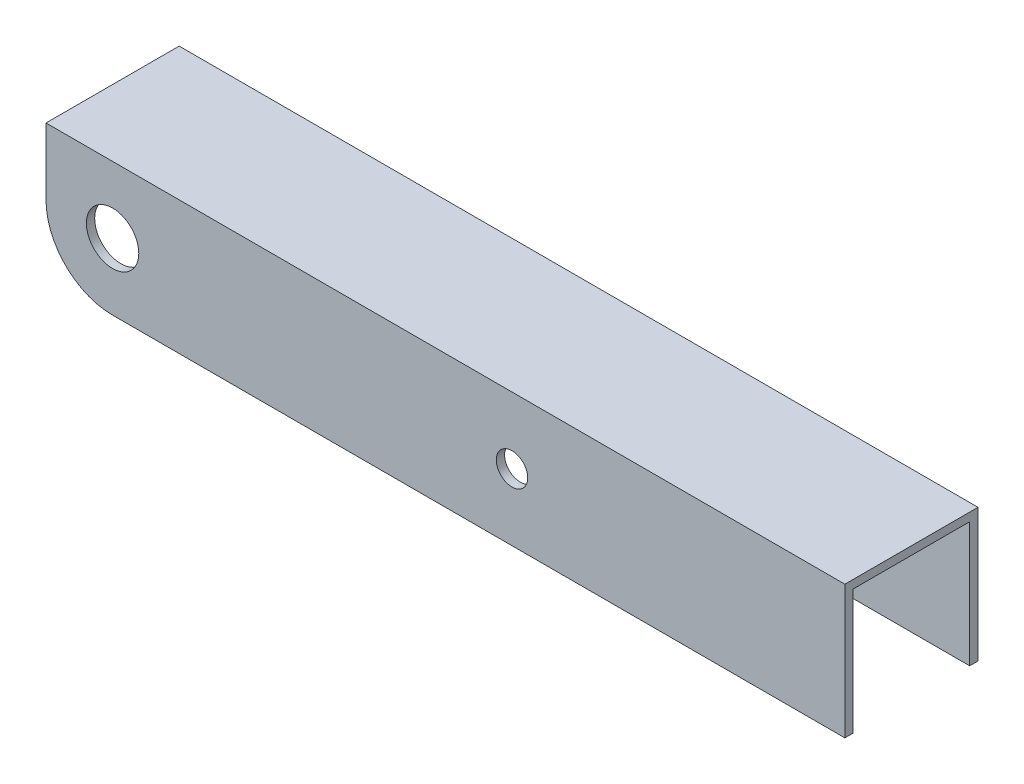
ISO-10303-21;
HEADER;
FILE_DESCRIPTION(('STEP AP214'),'2;1');
FILE_NAME('part.step','',(''),(''),'','','');
FILE_SCHEMA(('AUTOMOTIVE_DESIGN { 1 0 10303 214 1 1 1 1 }'));
ENDSEC;
DATA;
#1=APPLICATION_CONTEXT('core data for automotive mechanical design processes');
#2=APPLICATION_PROTOCOL_DEFINITION('international standard','automotive_design',2000,#1);
#3=PRODUCT_CONTEXT('',#1,'mechanical');
#4=PRODUCT('Part','Part','',(#3));
#5=PRODUCT_RELATED_PRODUCT_CATEGORY('part','',(#4));
#6=PRODUCT_DEFINITION_FORMATION('','',#4);
#7=PRODUCT_DEFINITION_CONTEXT('part definition',#1,'design');
#8=PRODUCT_DEFINITION('design','',#6,#7);
#9=PRODUCT_DEFINITION_SHAPE('','',#8);
#10=(LENGTH_UNIT() NAMED_UNIT(*) SI_UNIT(.MILLI.,.METRE.));
#11=(NAMED_UNIT(*) PLANE_ANGLE_UNIT() SI_UNIT($,.RADIAN.));
#12=(NAMED_UNIT(*) SI_UNIT($,.STERADIAN.) SOLID_ANGLE_UNIT());
#13=UNCERTAINTY_MEASURE_WITH_UNIT(LENGTH_MEASURE(1.E-05),#10,'distance_accuracy_value','');
#14=(GEOMETRIC_REPRESENTATION_CONTEXT(3) GLOBAL_UNCERTAINTY_ASSIGNED_CONTEXT((#13)) GLOBAL_UNIT_ASSIGNED_CONTEXT((#10,
#11,#12)) REPRESENTATION_CONTEXT('',''));
#15=CARTESIAN_POINT('',(0.,0.,0.));
#16=DIRECTION('',(0.,0.,1.));
#17=DIRECTION('',(1.,0.,0.));
#18=AXIS2_PLACEMENT_3D('',#15,#16,#17);
#19=CARTESIAN_POINT('',(152.4,0.,0.));
#20=DIRECTION('',(-1.,0.,0.));
#21=DIRECTION('',(0.,0.,1.));
#22=AXIS2_PLACEMENT_3D('',#19,#20,#21);
#23=PLANE('',#22);
#24=DIRECTION('',(0.,-1.,0.));
#25=VECTOR('',#24,1.);
#26=CARTESIAN_POINT('',(152.4,0.,0.));
#27=LINE('',#26,#25);
#28=CARTESIAN_POINT('',(152.4,50.8,0.));
#29=VERTEX_POINT('',#28);
#30=CARTESIAN_POINT('',(152.4,25.4,0.));
#31=VERTEX_POINT('',#30);
#32=EDGE_CURVE('E131',#29,#31,#27,.T.);
#33=ORIENTED_EDGE('',*,*,#32,.T.);
#34=DIRECTION('',(0.,0.,1.));
#35=VECTOR('',#34,1.);
#36=CARTESIAN_POINT('',(152.4,25.4,-152.4));
#37=LINE('',#36,#35);
#38=CARTESIAN_POINT('',(152.4,25.4,-1.58750000000005));
#39=VERTEX_POINT('',#38);
#40=EDGE_CURVE('E113',#39,#31,#37,.T.);
#41=ORIENTED_EDGE('',*,*,#40,.F.);
#42=DIRECTION('',(0.,-1.,0.));
#43=VECTOR('',#42,1.);
#44=CARTESIAN_POINT('',(152.4,1.5875,-1.5875));
#45=LINE('',#44,#43);
#46=CARTESIAN_POINT('',(152.4,49.2125,-1.5875));
#47=VERTEX_POINT('',#46);
#48=EDGE_CURVE('E208',#47,#39,#45,.T.);
#49=ORIENTED_EDGE('',*,*,#48,.F.);
#50=DIRECTION('',(0.,0.,1.));
#51=VECTOR('',#50,1.);
#52=CARTESIAN_POINT('',(152.4,49.2125,-1.5875));
#53=LINE('',#52,#51);
#54=CARTESIAN_POINT('',(152.4,49.2125,-23.8125));
#55=VERTEX_POINT('',#54);
#56=EDGE_CURVE('E216',#55,#47,#53,.T.);
#57=ORIENTED_EDGE('',*,*,#56,.F.);
#58=DIRECTION('',(0.,1.,0.));
#59=VECTOR('',#58,1.);
#60=CARTESIAN_POINT('',(152.4,1.5875,-23.8125));
#61=LINE('',#60,#59);
#62=CARTESIAN_POINT('',(152.4,25.4,-23.8125));
#63=VERTEX_POINT('',#62);
#64=EDGE_CURVE('E221',#63,#55,#61,.T.);
#65=ORIENTED_EDGE('',*,*,#64,.F.);
#66=CARTESIAN_POINT('',(152.4,25.4,-25.4000000000001));
#67=VERTEX_POINT('',#66);
#68=EDGE_CURVE('E62',#67,#63,#37,.T.);
#69=ORIENTED_EDGE('',*,*,#68,.F.);
#70=DIRECTION('',(0.,1.,0.));
#71=VECTOR('',#70,1.);
#72=CARTESIAN_POINT('',(152.4,0.,-25.4));
#73=LINE('',#72,#71);
#74=CARTESIAN_POINT('',(152.4,50.8,-25.4));
#75=VERTEX_POINT('',#74);
#76=EDGE_CURVE('E139',#67,#75,#73,.T.);
#77=ORIENTED_EDGE('',*,*,#76,.T.);
#78=DIRECTION('',(0.,0.,1.));
#79=VECTOR('',#78,1.);
#80=CARTESIAN_POINT('',(152.4,50.8,0.));
#81=LINE('',#80,#79);
#82=EDGE_CURVE('E136',#75,#29,#81,.T.);
#83=ORIENTED_EDGE('',*,*,#82,.T.);
#84=EDGE_LOOP('',(#33,#41,#49,#57,#65,#69,#77,#83));
#85=FACE_BOUND('',#84,.T.);
#86=ADVANCED_FACE('F38',(#85),#23,.F.);
#87=CARTESIAN_POINT('',(0.,0.,0.));
#88=DIRECTION('',(-1.,0.,0.));
#89=DIRECTION('',(0.,0.,1.));
#90=AXIS2_PLACEMENT_3D('',#87,#88,#89);
#91=PLANE('',#90);
#92=DIRECTION('',(0.,0.,1.));
#93=VECTOR('',#92,1.);
#94=CARTESIAN_POINT('',(0.,38.1,-152.4));
#95=LINE('',#94,#93);
#96=CARTESIAN_POINT('',(0.,38.1,-1.58750000000007));
#97=VERTEX_POINT('',#96);
#98=CARTESIAN_POINT('',(0.,38.1,0.));
#99=VERTEX_POINT('',#98);
#100=EDGE_CURVE('E191',#97,#99,#95,.T.);
#101=ORIENTED_EDGE('',*,*,#100,.T.);
#102=DIRECTION('',(0.,-1.,0.));
#103=VECTOR('',#102,1.);
#104=CARTESIAN_POINT('',(0.,0.,0.));
#105=LINE('',#104,#103);
#106=CARTESIAN_POINT('',(0.,50.8,0.));
#107=VERTEX_POINT('',#106);
#108=EDGE_CURVE('E154',#107,#99,#105,.T.);
#109=ORIENTED_EDGE('',*,*,#108,.F.);
#110=DIRECTION('',(0.,0.,1.));
#111=VECTOR('',#110,1.);
#112=CARTESIAN_POINT('',(0.,50.8,0.));
#113=LINE('',#112,#111);
#114=CARTESIAN_POINT('',(0.,50.8,-25.4));
#115=VERTEX_POINT('',#114);
#116=EDGE_CURVE('E140',#115,#107,#113,.T.);
#117=ORIENTED_EDGE('',*,*,#116,.F.);
#118=DIRECTION('',(0.,1.,0.));
#119=VECTOR('',#118,1.);
#120=CARTESIAN_POINT('',(0.,0.,-25.4));
#121=LINE('',#120,#119);
#122=CARTESIAN_POINT('',(0.,38.1,-25.4000000000001));
#123=VERTEX_POINT('',#122);
#124=EDGE_CURVE('E145',#123,#115,#121,.T.);
#125=ORIENTED_EDGE('',*,*,#124,.F.);
#126=CARTESIAN_POINT('',(0.,38.1,-23.8125000000001));
#127=VERTEX_POINT('',#126);
#128=EDGE_CURVE('E253',#123,#127,#95,.T.);
#129=ORIENTED_EDGE('',*,*,#128,.T.);
#130=DIRECTION('',(0.,1.,0.));
#131=VECTOR('',#130,1.);
#132=CARTESIAN_POINT('',(0.,1.5875,-23.8125));
#133=LINE('',#132,#131);
#134=CARTESIAN_POINT('',(0.,49.2125,-23.8125));
#135=VERTEX_POINT('',#134);
#136=EDGE_CURVE('E197',#127,#135,#133,.T.);
#137=ORIENTED_EDGE('',*,*,#136,.T.);
#138=DIRECTION('',(0.,0.,1.));
#139=VECTOR('',#138,1.);
#140=CARTESIAN_POINT('',(0.,49.2125,-1.5875));
#141=LINE('',#140,#139);
#142=CARTESIAN_POINT('',(0.,49.2125,-1.5875));
#143=VERTEX_POINT('',#142);
#144=EDGE_CURVE('E203',#135,#143,#141,.T.);
#145=ORIENTED_EDGE('',*,*,#144,.T.);
#146=DIRECTION('',(0.,-1.,0.));
#147=VECTOR('',#146,1.);
#148=CARTESIAN_POINT('',(0.,1.5875,-1.5875));
#149=LINE('',#148,#147);
#150=EDGE_CURVE('E204',#143,#97,#149,.T.);
#151=ORIENTED_EDGE('',*,*,#150,.T.);
#152=EDGE_LOOP('',(#101,#109,#117,#125,#129,#137,#145,#151));
#153=FACE_BOUND('',#152,.T.);
#154=ADVANCED_FACE('F270',(#153),#91,.T.);
#155=CARTESIAN_POINT('',(152.4,0.,0.));
#156=DIRECTION('',(0.,0.,-1.));
#157=DIRECTION('',(-1.,0.,0.));
#158=AXIS2_PLACEMENT_3D('',#155,#156,#157);
#159=PLANE('',#158);
#160=CARTESIAN_POINT('',(12.7,38.1,0.));
#161=DIRECTION('',(0.,0.,1.));
#162=DIRECTION('',(1.,0.,0.));
#163=AXIS2_PLACEMENT_3D('',#160,#161,#162);
#164=CIRCLE('',#163,5.);
#165=CARTESIAN_POINT('',(17.7,38.1,0.));
#166=VERTEX_POINT('',#165);
#167=EDGE_CURVE('E133',#166,#166,#164,.T.);
#168=ORIENTED_EDGE('',*,*,#167,.F.);
#169=EDGE_LOOP('',(#168));
#170=FACE_BOUND('',#169,.T.);
#171=CARTESIAN_POINT('',(88.9,38.1,0.));
#172=DIRECTION('',(0.,0.,1.));
#173=DIRECTION('',(1.,0.,0.));
#174=AXIS2_PLACEMENT_3D('',#171,#172,#173);
#175=CIRCLE('',#174,3.00000000000001);
#176=CARTESIAN_POINT('',(91.9,38.1,0.));
#177=VERTEX_POINT('',#176);
#178=EDGE_CURVE('E170',#177,#177,#175,.T.);
#179=ORIENTED_EDGE('',*,*,#178,.F.);
#180=EDGE_LOOP('',(#179));
#181=FACE_BOUND('',#180,.T.);
#182=ORIENTED_EDGE('',*,*,#108,.T.);
#183=CARTESIAN_POINT('',(12.7,38.1,0.));
#184=DIRECTION('',(0.,0.,-1.));
#185=DIRECTION('',(1.,0.,0.));
#186=AXIS2_PLACEMENT_3D('',#183,#184,#185);
#187=CIRCLE('',#186,12.7);
#188=CARTESIAN_POINT('',(12.7,25.4,0.));
#189=VERTEX_POINT('',#188);
#190=EDGE_CURVE('E125',#189,#99,#187,.T.);
#191=ORIENTED_EDGE('',*,*,#190,.F.);
#192=DIRECTION('',(-1.,0.,0.));
#193=VECTOR('',#192,1.);
#194=CARTESIAN_POINT('',(12.7,25.4,0.));
#195=LINE('',#194,#193);
#196=EDGE_CURVE('E116',#31,#189,#195,.T.);
#197=ORIENTED_EDGE('',*,*,#196,.F.);
#198=ORIENTED_EDGE('',*,*,#32,.F.);
#199=DIRECTION('',(-1.,0.,0.));
#200=VECTOR('',#199,1.);
#201=CARTESIAN_POINT('',(152.4,50.8,0.));
#202=LINE('',#201,#200);
#203=EDGE_CURVE('E153',#29,#107,#202,.T.);
#204=ORIENTED_EDGE('',*,*,#203,.T.);
#205=EDGE_LOOP('',(#182,#191,#197,#198,#204));
#206=FACE_BOUND('',#205,.T.);
#207=ADVANCED_FACE('F40',(#170,#181,#206),#159,.F.);
#208=CARTESIAN_POINT('',(152.4,0.,-25.4));
#209=DIRECTION('',(0.,0.,1.));
#210=DIRECTION('',(0.,-1.,0.));
#211=AXIS2_PLACEMENT_3D('',#208,#209,#210);
#212=PLANE('',#211);
#213=CARTESIAN_POINT('',(12.7,38.1,-25.4));
#214=DIRECTION('',(0.,0.,1.));
#215=DIRECTION('',(0.,-1.,0.));
#216=AXIS2_PLACEMENT_3D('',#213,#214,#215);
#217=CIRCLE('',#216,5.);
#218=CARTESIAN_POINT('',(12.7,33.1,-25.4));
#219=VERTEX_POINT('',#218);
#220=EDGE_CURVE('E238',#219,#219,#217,.T.);
#221=ORIENTED_EDGE('',*,*,#220,.T.);
#222=EDGE_LOOP('',(#221));
#223=FACE_BOUND('',#222,.T.);
#224=CARTESIAN_POINT('',(88.9,38.1,-25.4));
#225=DIRECTION('',(0.,0.,1.));
#226=DIRECTION('',(0.,-1.,0.));
#227=AXIS2_PLACEMENT_3D('',#224,#225,#226);
#228=CIRCLE('',#227,3.00000000000001);
#229=CARTESIAN_POINT('',(88.9,35.1,-25.4));
#230=VERTEX_POINT('',#229);
#231=EDGE_CURVE('E175',#230,#230,#228,.T.);
#232=ORIENTED_EDGE('',*,*,#231,.T.);
#233=EDGE_LOOP('',(#232));
#234=FACE_BOUND('',#233,.T.);
#235=DIRECTION('',(-1.,0.,0.));
#236=VECTOR('',#235,1.);
#237=CARTESIAN_POINT('',(152.4,25.4,-25.4));
#238=LINE('',#237,#236);
#239=CARTESIAN_POINT('',(12.7,25.4,-25.4000000000001));
#240=VERTEX_POINT('',#239);
#241=EDGE_CURVE('E233',#67,#240,#238,.T.);
#242=ORIENTED_EDGE('',*,*,#241,.T.);
#243=CARTESIAN_POINT('',(12.7,38.1,-25.4));
#244=DIRECTION('',(0.,0.,1.));
#245=DIRECTION('',(0.,-1.,0.));
#246=AXIS2_PLACEMENT_3D('',#243,#244,#245);
#247=CIRCLE('',#246,12.7);
#248=EDGE_CURVE('E189',#240,#123,#247,.F.);
#249=ORIENTED_EDGE('',*,*,#248,.T.);
#250=ORIENTED_EDGE('',*,*,#124,.T.);
#251=DIRECTION('',(-1.,0.,0.));
#252=VECTOR('',#251,1.);
#253=CARTESIAN_POINT('',(152.4,50.8,-25.4));
#254=LINE('',#253,#252);
#255=EDGE_CURVE('E161',#75,#115,#254,.T.);
#256=ORIENTED_EDGE('',*,*,#255,.F.);
#257=ORIENTED_EDGE('',*,*,#76,.F.);
#258=EDGE_LOOP('',(#242,#249,#250,#256,#257));
#259=FACE_BOUND('',#258,.T.);
#260=ADVANCED_FACE('F269',(#223,#234,#259),#212,.F.);
#261=CARTESIAN_POINT('',(152.4,50.8,0.));
#262=DIRECTION('',(0.,-1.,0.));
#263=DIRECTION('',(0.,0.,-1.));
#264=AXIS2_PLACEMENT_3D('',#261,#262,#263);
#265=PLANE('',#264);
#266=ORIENTED_EDGE('',*,*,#116,.T.);
#267=ORIENTED_EDGE('',*,*,#203,.F.);
#268=ORIENTED_EDGE('',*,*,#82,.F.);
#269=ORIENTED_EDGE('',*,*,#255,.T.);
#270=EDGE_LOOP('',(#266,#267,#268,#269));
#271=FACE_BOUND('',#270,.T.);
#272=ADVANCED_FACE('F303',(#271),#265,.F.);
#273=CARTESIAN_POINT('',(152.4,1.5875,-1.5875));
#274=DIRECTION('',(0.,0.,-1.));
#275=DIRECTION('',(-1.,0.,0.));
#276=AXIS2_PLACEMENT_3D('',#273,#274,#275);
#277=PLANE('',#276);
#278=CARTESIAN_POINT('',(12.7,38.1,-1.58750000000002));
#279=DIRECTION('',(0.,0.,-1.));
#280=DIRECTION('',(-1.,0.,0.));
#281=AXIS2_PLACEMENT_3D('',#278,#279,#280);
#282=CIRCLE('',#281,12.7);
#283=CARTESIAN_POINT('',(12.7,25.4,-1.5875));
#284=VERTEX_POINT('',#283);
#285=EDGE_CURVE('E230',#97,#284,#282,.F.);
#286=ORIENTED_EDGE('',*,*,#285,.F.);
#287=ORIENTED_EDGE('',*,*,#150,.F.);
#288=DIRECTION('',(-1.,0.,0.));
#289=VECTOR('',#288,1.);
#290=CARTESIAN_POINT('',(152.4,49.2125,-1.5875));
#291=LINE('',#290,#289);
#292=EDGE_CURVE('E213',#47,#143,#291,.T.);
#293=ORIENTED_EDGE('',*,*,#292,.F.);
#294=ORIENTED_EDGE('',*,*,#48,.T.);
#295=DIRECTION('',(1.,0.,0.));
#296=VECTOR('',#295,1.);
#297=CARTESIAN_POINT('',(152.4,25.4,-1.5875));
#298=LINE('',#297,#296);
#299=EDGE_CURVE('E119',#284,#39,#298,.T.);
#300=ORIENTED_EDGE('',*,*,#299,.F.);
#301=EDGE_LOOP('',(#286,#287,#293,#294,#300));
#302=FACE_BOUND('',#301,.T.);
#303=CARTESIAN_POINT('',(12.7,38.1,-1.58750000000002));
#304=DIRECTION('',(0.,0.,-1.));
#305=DIRECTION('',(-1.,0.,0.));
#306=AXIS2_PLACEMENT_3D('',#303,#304,#305);
#307=CIRCLE('',#306,5.);
#308=CARTESIAN_POINT('',(7.69999999999999,38.1,-1.58750000000002));
#309=VERTEX_POINT('',#308);
#310=EDGE_CURVE('E174',#309,#309,#307,.T.);
#311=ORIENTED_EDGE('',*,*,#310,.F.);
#312=EDGE_LOOP('',(#311));
#313=FACE_BOUND('',#312,.T.);
#314=CARTESIAN_POINT('',(88.9,38.1,-1.58750000000002));
#315=DIRECTION('',(0.,0.,-1.));
#316=DIRECTION('',(-1.,0.,0.));
#317=AXIS2_PLACEMENT_3D('',#314,#315,#316);
#318=CIRCLE('',#317,3.00000000000001);
#319=CARTESIAN_POINT('',(85.9,38.1,-1.58750000000002));
#320=VERTEX_POINT('',#319);
#321=EDGE_CURVE('E169',#320,#320,#318,.T.);
#322=ORIENTED_EDGE('',*,*,#321,.F.);
#323=EDGE_LOOP('',(#322));
#324=FACE_BOUND('',#323,.T.);
#325=ADVANCED_FACE('F300',(#302,#313,#324),#277,.T.);
#326=CARTESIAN_POINT('',(152.4,1.5875,-23.8125));
#327=DIRECTION('',(0.,0.,1.));
#328=DIRECTION('',(1.,0.,0.));
#329=AXIS2_PLACEMENT_3D('',#326,#327,#328);
#330=PLANE('',#329);
#331=CARTESIAN_POINT('',(12.7,38.1,-23.8125));
#332=DIRECTION('',(0.,0.,1.));
#333=DIRECTION('',(1.,0.,0.));
#334=AXIS2_PLACEMENT_3D('',#331,#332,#333);
#335=CIRCLE('',#334,12.7);
#336=CARTESIAN_POINT('',(12.7,25.4,-23.8125000000001));
#337=VERTEX_POINT('',#336);
#338=EDGE_CURVE('E11',#337,#127,#335,.F.);
#339=ORIENTED_EDGE('',*,*,#338,.F.);
#340=DIRECTION('',(-1.,0.,0.));
#341=VECTOR('',#340,1.);
#342=CARTESIAN_POINT('',(152.4,25.4,-23.8125));
#343=LINE('',#342,#341);
#344=EDGE_CURVE('E47',#63,#337,#343,.T.);
#345=ORIENTED_EDGE('',*,*,#344,.F.);
#346=ORIENTED_EDGE('',*,*,#64,.T.);
#347=DIRECTION('',(-1.,0.,0.));
#348=VECTOR('',#347,1.);
#349=CARTESIAN_POINT('',(152.4,49.2125,-23.8125));
#350=LINE('',#349,#348);
#351=EDGE_CURVE('E148',#55,#135,#350,.T.);
#352=ORIENTED_EDGE('',*,*,#351,.T.);
#353=ORIENTED_EDGE('',*,*,#136,.F.);
#354=EDGE_LOOP('',(#339,#345,#346,#352,#353));
#355=FACE_BOUND('',#354,.T.);
#356=CARTESIAN_POINT('',(12.7,38.1,-23.8125));
#357=DIRECTION('',(0.,0.,1.));
#358=DIRECTION('',(1.,0.,0.));
#359=AXIS2_PLACEMENT_3D('',#356,#357,#358);
#360=CIRCLE('',#359,5.);
#361=CARTESIAN_POINT('',(17.7,38.1,-23.8125));
#362=VERTEX_POINT('',#361);
#363=EDGE_CURVE('E171',#362,#362,#360,.T.);
#364=ORIENTED_EDGE('',*,*,#363,.F.);
#365=EDGE_LOOP('',(#364));
#366=FACE_BOUND('',#365,.T.);
#367=CARTESIAN_POINT('',(88.9,38.1,-23.8125));
#368=DIRECTION('',(0.,0.,1.));
#369=DIRECTION('',(1.,0.,0.));
#370=AXIS2_PLACEMENT_3D('',#367,#368,#369);
#371=CIRCLE('',#370,3.00000000000001);
#372=CARTESIAN_POINT('',(91.9,38.1,-23.8125));
#373=VERTEX_POINT('',#372);
#374=EDGE_CURVE('E165',#373,#373,#371,.T.);
#375=ORIENTED_EDGE('',*,*,#374,.F.);
#376=EDGE_LOOP('',(#375));
#377=FACE_BOUND('',#376,.T.);
#378=ADVANCED_FACE('F194',(#355,#366,#377),#330,.T.);
#379=CARTESIAN_POINT('',(152.4,49.2125,-1.5875));
#380=DIRECTION('',(0.,-1.,0.));
#381=DIRECTION('',(0.,0.,-1.));
#382=AXIS2_PLACEMENT_3D('',#379,#380,#381);
#383=PLANE('',#382);
#384=ORIENTED_EDGE('',*,*,#144,.F.);
#385=ORIENTED_EDGE('',*,*,#351,.F.);
#386=ORIENTED_EDGE('',*,*,#56,.T.);
#387=ORIENTED_EDGE('',*,*,#292,.T.);
#388=EDGE_LOOP('',(#384,#385,#386,#387));
#389=FACE_BOUND('',#388,.T.);
#390=ADVANCED_FACE('F290',(#389),#383,.T.);
#391=CARTESIAN_POINT('',(88.9,38.1,-152.4));
#392=DIRECTION('',(0.,0.,1.));
#393=DIRECTION('',(1.,0.,0.));
#394=AXIS2_PLACEMENT_3D('',#391,#392,#393);
#395=CYLINDRICAL_SURFACE('',#394,3.00000000000001);
#396=ORIENTED_EDGE('',*,*,#374,.T.);
#397=EDGE_LOOP('',(#396));
#398=FACE_BOUND('',#397,.T.);
#399=ORIENTED_EDGE('',*,*,#231,.F.);
#400=EDGE_LOOP('',(#399));
#401=FACE_BOUND('',#400,.T.);
#402=ADVANCED_FACE('F277',(#398,#401),#395,.F.);
#403=CARTESIAN_POINT('',(12.7,38.1,-152.4));
#404=DIRECTION('',(0.,0.,1.));
#405=DIRECTION('',(1.,0.,0.));
#406=AXIS2_PLACEMENT_3D('',#403,#404,#405);
#407=CYLINDRICAL_SURFACE('',#406,5.);
#408=ORIENTED_EDGE('',*,*,#363,.T.);
#409=EDGE_LOOP('',(#408));
#410=FACE_BOUND('',#409,.T.);
#411=ORIENTED_EDGE('',*,*,#220,.F.);
#412=EDGE_LOOP('',(#411));
#413=FACE_BOUND('',#412,.T.);
#414=ADVANCED_FACE('F285',(#410,#413),#407,.F.);
#415=CARTESIAN_POINT('',(12.7,25.4,-152.4));
#416=DIRECTION('',(0.,1.,0.));
#417=DIRECTION('',(-1.,0.,0.));
#418=AXIS2_PLACEMENT_3D('',#415,#416,#417);
#419=PLANE('',#418);
#420=ORIENTED_EDGE('',*,*,#68,.T.);
#421=ORIENTED_EDGE('',*,*,#344,.T.);
#422=DIRECTION('',(0.,0.,1.));
#423=VECTOR('',#422,1.);
#424=CARTESIAN_POINT('',(12.7,25.4,-152.4));
#425=LINE('',#424,#423);
#426=EDGE_CURVE('E180',#240,#337,#425,.T.);
#427=ORIENTED_EDGE('',*,*,#426,.F.);
#428=ORIENTED_EDGE('',*,*,#241,.F.);
#429=EDGE_LOOP('',(#420,#421,#427,#428));
#430=FACE_BOUND('',#429,.T.);
#431=ADVANCED_FACE('F179',(#430),#419,.F.);
#432=CARTESIAN_POINT('',(12.7,38.1,-152.4));
#433=DIRECTION('',(0.,0.,1.));
#434=DIRECTION('',(1.,0.,0.));
#435=AXIS2_PLACEMENT_3D('',#432,#433,#434);
#436=CYLINDRICAL_SURFACE('',#435,12.7);
#437=ORIENTED_EDGE('',*,*,#426,.T.);
#438=ORIENTED_EDGE('',*,*,#338,.T.);
#439=ORIENTED_EDGE('',*,*,#128,.F.);
#440=ORIENTED_EDGE('',*,*,#248,.F.);
#441=EDGE_LOOP('',(#437,#438,#439,#440));
#442=FACE_BOUND('',#441,.T.);
#443=ADVANCED_FACE('F186',(#442),#436,.T.);
#444=ORIENTED_EDGE('',*,*,#321,.T.);
#445=EDGE_LOOP('',(#444));
#446=FACE_BOUND('',#445,.T.);
#447=ORIENTED_EDGE('',*,*,#178,.T.);
#448=EDGE_LOOP('',(#447));
#449=FACE_BOUND('',#448,.T.);
#450=ADVANCED_FACE('F273',(#446,#449),#395,.F.);
#451=ORIENTED_EDGE('',*,*,#310,.T.);
#452=EDGE_LOOP('',(#451));
#453=FACE_BOUND('',#452,.T.);
#454=ORIENTED_EDGE('',*,*,#167,.T.);
#455=EDGE_LOOP('',(#454));
#456=FACE_BOUND('',#455,.T.);
#457=ADVANCED_FACE('F265',(#453,#456),#407,.F.);
#458=ORIENTED_EDGE('',*,*,#285,.T.);
#459=EDGE_CURVE('E54',#284,#189,#425,.T.);
#460=ORIENTED_EDGE('',*,*,#459,.T.);
#461=ORIENTED_EDGE('',*,*,#190,.T.);
#462=ORIENTED_EDGE('',*,*,#100,.F.);
#463=EDGE_LOOP('',(#458,#460,#461,#462));
#464=FACE_BOUND('',#463,.T.);
#465=ADVANCED_FACE('F282',(#464),#436,.T.);
#466=ORIENTED_EDGE('',*,*,#299,.T.);
#467=ORIENTED_EDGE('',*,*,#40,.T.);
#468=ORIENTED_EDGE('',*,*,#196,.T.);
#469=ORIENTED_EDGE('',*,*,#459,.F.);
#470=EDGE_LOOP('',(#466,#467,#468,#469));
#471=FACE_BOUND('',#470,.T.);
#472=ADVANCED_FACE('F115',(#471),#419,.F.);
#473=CLOSED_SHELL('',(#86,#154,#207,#260,#272,#325,#378,#390,#402,#414,#431,#443,#450,#457,#465,#472));
#474=MANIFOLD_SOLID_BREP('B2',#473);
#475=ADVANCED_BREP_SHAPE_REPRESENTATION('',(#18,#474),#14);
#476=SHAPE_DEFINITION_REPRESENTATION(#9,#475);
ENDSEC;
END-ISO-10303-21;
